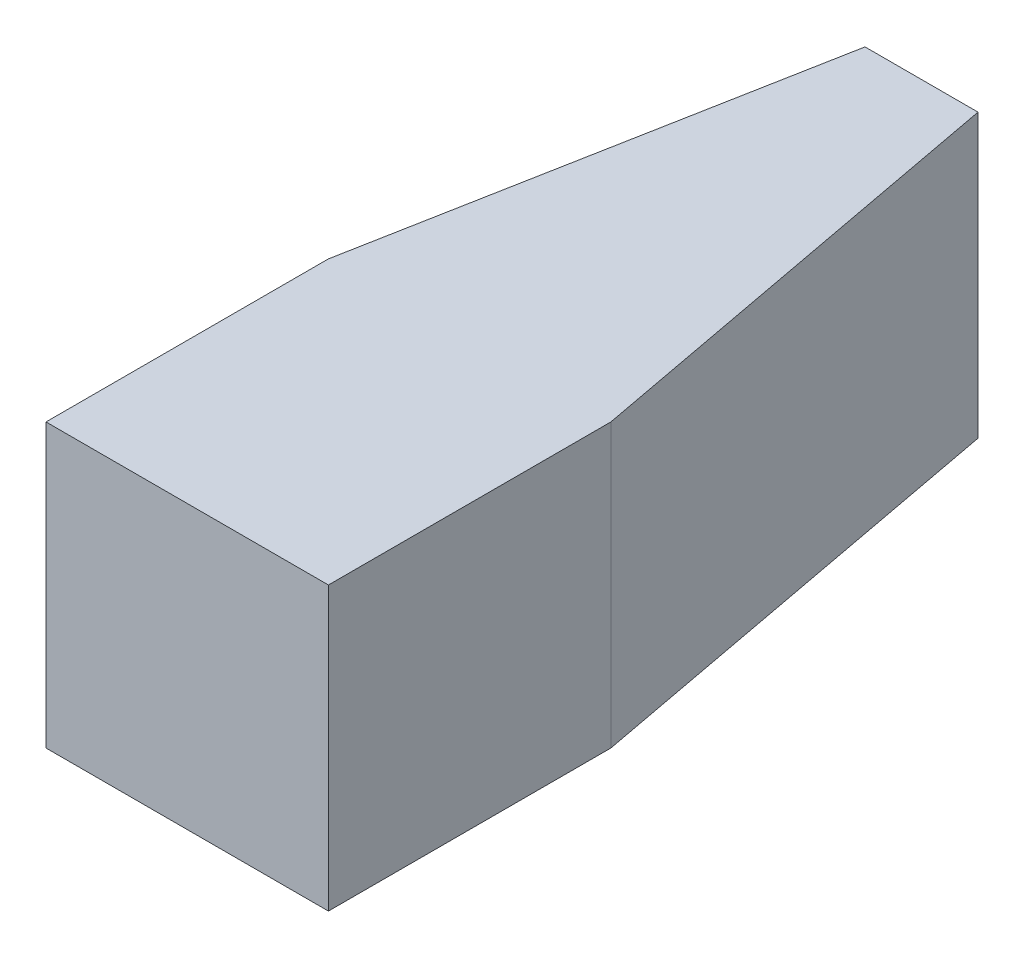
ISO-10303-21;
HEADER;
FILE_DESCRIPTION(('STEP AP214'),'2;1');
FILE_NAME('part.step','',(''),(''),'','','');
FILE_SCHEMA(('AUTOMOTIVE_DESIGN { 1 0 10303 214 1 1 1 1 }'));
ENDSEC;
DATA;
#1=APPLICATION_CONTEXT('core data for automotive mechanical design processes');
#2=APPLICATION_PROTOCOL_DEFINITION('international standard','automotive_design',2000,#1);
#3=PRODUCT_CONTEXT('',#1,'mechanical');
#4=PRODUCT('Part','Part','',(#3));
#5=PRODUCT_RELATED_PRODUCT_CATEGORY('part','',(#4));
#6=PRODUCT_DEFINITION_FORMATION('','',#4);
#7=PRODUCT_DEFINITION_CONTEXT('part definition',#1,'design');
#8=PRODUCT_DEFINITION('design','',#6,#7);
#9=PRODUCT_DEFINITION_SHAPE('','',#8);
#10=(LENGTH_UNIT() NAMED_UNIT(*) SI_UNIT(.MILLI.,.METRE.));
#11=(NAMED_UNIT(*) PLANE_ANGLE_UNIT() SI_UNIT($,.RADIAN.));
#12=(NAMED_UNIT(*) SI_UNIT($,.STERADIAN.) SOLID_ANGLE_UNIT());
#13=UNCERTAINTY_MEASURE_WITH_UNIT(LENGTH_MEASURE(1.E-05),#10,'distance_accuracy_value','');
#14=(GEOMETRIC_REPRESENTATION_CONTEXT(3) GLOBAL_UNCERTAINTY_ASSIGNED_CONTEXT((#13)) GLOBAL_UNIT_ASSIGNED_CONTEXT((#10,
#11,#12)) REPRESENTATION_CONTEXT('',''));
#15=CARTESIAN_POINT('',(0.,0.,0.));
#16=DIRECTION('',(0.,0.,1.));
#17=DIRECTION('',(1.,0.,0.));
#18=AXIS2_PLACEMENT_3D('',#15,#16,#17);
#19=CARTESIAN_POINT('',(-3.175,3.175,-3.175));
#20=DIRECTION('',(1.,0.,0.));
#21=DIRECTION('',(0.,0.,-1.));
#22=AXIS2_PLACEMENT_3D('',#19,#20,#21);
#23=PLANE('',#22);
#24=DIRECTION('',(0.,0.,1.));
#25=VECTOR('',#24,1.);
#26=CARTESIAN_POINT('',(-3.175,0.,-3.175));
#27=LINE('',#26,#25);
#28=CARTESIAN_POINT('',(-3.175,0.,-3.175));
#29=VERTEX_POINT('',#28);
#30=CARTESIAN_POINT('',(-3.175,0.,0.));
#31=VERTEX_POINT('',#30);
#32=EDGE_CURVE('E116',#29,#31,#27,.T.);
#33=ORIENTED_EDGE('',*,*,#32,.T.);
#34=DIRECTION('',(0.,-1.,0.));
#35=VECTOR('',#34,1.);
#36=CARTESIAN_POINT('',(-3.175,3.175,0.));
#37=LINE('',#36,#35);
#38=CARTESIAN_POINT('',(-3.175,3.175,0.));
#39=VERTEX_POINT('',#38);
#40=EDGE_CURVE('E11',#39,#31,#37,.T.);
#41=ORIENTED_EDGE('',*,*,#40,.F.);
#42=DIRECTION('',(0.,0.,1.));
#43=VECTOR('',#42,1.);
#44=CARTESIAN_POINT('',(-3.175,3.175,-3.175));
#45=LINE('',#44,#43);
#46=CARTESIAN_POINT('',(-3.175,3.175,-3.175));
#47=VERTEX_POINT('',#46);
#48=EDGE_CURVE('E126',#47,#39,#45,.T.);
#49=ORIENTED_EDGE('',*,*,#48,.F.);
#50=DIRECTION('',(0.,-1.,0.));
#51=VECTOR('',#50,1.);
#52=CARTESIAN_POINT('',(-3.175,3.175,-3.175));
#53=LINE('',#52,#51);
#54=EDGE_CURVE('E112',#47,#29,#53,.T.);
#55=ORIENTED_EDGE('',*,*,#54,.T.);
#56=EDGE_LOOP('',(#33,#41,#49,#55));
#57=FACE_BOUND('',#56,.T.);
#58=ADVANCED_FACE('F32',(#57),#23,.F.);
#59=CARTESIAN_POINT('',(-3.175,3.175,0.));
#60=DIRECTION('',(0.,0.,-1.));
#61=DIRECTION('',(-1.,0.,0.));
#62=AXIS2_PLACEMENT_3D('',#59,#60,#61);
#63=PLANE('',#62);
#64=DIRECTION('',(1.,0.,0.));
#65=VECTOR('',#64,1.);
#66=CARTESIAN_POINT('',(-3.175,0.,0.));
#67=LINE('',#66,#65);
#68=CARTESIAN_POINT('',(0.,0.,0.));
#69=VERTEX_POINT('',#68);
#70=EDGE_CURVE('E119',#31,#69,#67,.T.);
#71=ORIENTED_EDGE('',*,*,#70,.T.);
#72=DIRECTION('',(0.,-1.,0.));
#73=VECTOR('',#72,1.);
#74=CARTESIAN_POINT('',(0.,3.175,0.));
#75=LINE('',#74,#73);
#76=CARTESIAN_POINT('',(0.,3.175,0.));
#77=VERTEX_POINT('',#76);
#78=EDGE_CURVE('E40',#77,#69,#75,.T.);
#79=ORIENTED_EDGE('',*,*,#78,.F.);
#80=DIRECTION('',(1.,0.,0.));
#81=VECTOR('',#80,1.);
#82=CARTESIAN_POINT('',(-3.175,3.175,0.));
#83=LINE('',#82,#81);
#84=EDGE_CURVE('E85',#39,#77,#83,.T.);
#85=ORIENTED_EDGE('',*,*,#84,.F.);
#86=ORIENTED_EDGE('',*,*,#40,.T.);
#87=EDGE_LOOP('',(#71,#79,#85,#86));
#88=FACE_BOUND('',#87,.T.);
#89=ADVANCED_FACE('F150',(#88),#63,.F.);
#90=CARTESIAN_POINT('',(0.,3.175,0.));
#91=DIRECTION('',(-1.,0.,0.));
#92=DIRECTION('',(0.,0.,1.));
#93=AXIS2_PLACEMENT_3D('',#90,#91,#92);
#94=PLANE('',#93);
#95=DIRECTION('',(0.,0.,-1.));
#96=VECTOR('',#95,1.);
#97=CARTESIAN_POINT('',(0.,0.,0.));
#98=LINE('',#97,#96);
#99=CARTESIAN_POINT('',(0.,0.,-3.175));
#100=VERTEX_POINT('',#99);
#101=EDGE_CURVE('E121',#69,#100,#98,.T.);
#102=ORIENTED_EDGE('',*,*,#101,.T.);
#103=DIRECTION('',(0.,-1.,0.));
#104=VECTOR('',#103,1.);
#105=CARTESIAN_POINT('',(0.,3.175,-3.175));
#106=LINE('',#105,#104);
#107=CARTESIAN_POINT('',(0.,3.175,-3.175));
#108=VERTEX_POINT('',#107);
#109=EDGE_CURVE('E107',#108,#100,#106,.T.);
#110=ORIENTED_EDGE('',*,*,#109,.F.);
#111=DIRECTION('',(0.,0.,-1.));
#112=VECTOR('',#111,1.);
#113=CARTESIAN_POINT('',(0.,3.175,0.));
#114=LINE('',#113,#112);
#115=EDGE_CURVE('E98',#77,#108,#114,.T.);
#116=ORIENTED_EDGE('',*,*,#115,.F.);
#117=ORIENTED_EDGE('',*,*,#78,.T.);
#118=EDGE_LOOP('',(#102,#110,#116,#117));
#119=FACE_BOUND('',#118,.T.);
#120=ADVANCED_FACE('F132',(#119),#94,.F.);
#121=CARTESIAN_POINT('',(0.,3.175,-3.175));
#122=DIRECTION('',(-0.982872186934322,0.,0.184288535050185));
#123=DIRECTION('',(0.184288535050185,0.,0.982872186934322));
#124=AXIS2_PLACEMENT_3D('',#121,#122,#123);
#125=PLANE('',#124);
#126=DIRECTION('',(-0.184288535050185,0.,-0.982872186934322));
#127=VECTOR('',#126,1.);
#128=CARTESIAN_POINT('',(0.,0.,-3.175));
#129=LINE('',#128,#127);
#130=CARTESIAN_POINT('',(-0.952499999999999,0.,-8.255));
#131=VERTEX_POINT('',#130);
#132=EDGE_CURVE('E106',#100,#131,#129,.T.);
#133=ORIENTED_EDGE('',*,*,#132,.T.);
#134=DIRECTION('',(0.,-1.,0.));
#135=VECTOR('',#134,1.);
#136=CARTESIAN_POINT('',(-0.952499999999999,3.175,-8.255));
#137=LINE('',#136,#135);
#138=CARTESIAN_POINT('',(-0.952499999999999,3.175,-8.255));
#139=VERTEX_POINT('',#138);
#140=EDGE_CURVE('E103',#139,#131,#137,.T.);
#141=ORIENTED_EDGE('',*,*,#140,.F.);
#142=DIRECTION('',(-0.184288535050185,0.,-0.982872186934322));
#143=VECTOR('',#142,1.);
#144=CARTESIAN_POINT('',(0.,3.175,-3.175));
#145=LINE('',#144,#143);
#146=EDGE_CURVE('E92',#108,#139,#145,.T.);
#147=ORIENTED_EDGE('',*,*,#146,.F.);
#148=ORIENTED_EDGE('',*,*,#109,.T.);
#149=EDGE_LOOP('',(#133,#141,#147,#148));
#150=FACE_BOUND('',#149,.T.);
#151=ADVANCED_FACE('F104',(#150),#125,.F.);
#152=CARTESIAN_POINT('',(-0.952499999999999,3.175,-8.255));
#153=DIRECTION('',(0.,0.,1.));
#154=DIRECTION('',(1.,0.,0.));
#155=AXIS2_PLACEMENT_3D('',#152,#153,#154);
#156=PLANE('',#155);
#157=DIRECTION('',(-1.,0.,0.));
#158=VECTOR('',#157,1.);
#159=CARTESIAN_POINT('',(-0.952499999999999,0.,-8.255));
#160=LINE('',#159,#158);
#161=CARTESIAN_POINT('',(-2.2225,0.,-8.255));
#162=VERTEX_POINT('',#161);
#163=EDGE_CURVE('E71',#131,#162,#160,.T.);
#164=ORIENTED_EDGE('',*,*,#163,.T.);
#165=DIRECTION('',(0.,-1.,0.));
#166=VECTOR('',#165,1.);
#167=CARTESIAN_POINT('',(-2.2225,3.175,-8.255));
#168=LINE('',#167,#166);
#169=CARTESIAN_POINT('',(-2.2225,3.175,-8.255));
#170=VERTEX_POINT('',#169);
#171=EDGE_CURVE('E108',#170,#162,#168,.T.);
#172=ORIENTED_EDGE('',*,*,#171,.F.);
#173=DIRECTION('',(-1.,0.,0.));
#174=VECTOR('',#173,1.);
#175=CARTESIAN_POINT('',(-0.952499999999999,3.175,-8.255));
#176=LINE('',#175,#174);
#177=EDGE_CURVE('E96',#139,#170,#176,.T.);
#178=ORIENTED_EDGE('',*,*,#177,.F.);
#179=ORIENTED_EDGE('',*,*,#140,.T.);
#180=EDGE_LOOP('',(#164,#172,#178,#179));
#181=FACE_BOUND('',#180,.T.);
#182=ADVANCED_FACE('F110',(#181),#156,.F.);
#183=CARTESIAN_POINT('',(-2.2225,3.175,-8.255));
#184=DIRECTION('',(0.982872186934322,0.,0.184288535050185));
#185=DIRECTION('',(0.184288535050185,0.,-0.982872186934322));
#186=AXIS2_PLACEMENT_3D('',#183,#184,#185);
#187=PLANE('',#186);
#188=DIRECTION('',(-0.184288535050185,0.,0.982872186934322));
#189=VECTOR('',#188,1.);
#190=CARTESIAN_POINT('',(-2.2225,0.,-8.255));
#191=LINE('',#190,#189);
#192=EDGE_CURVE('E77',#162,#29,#191,.T.);
#193=ORIENTED_EDGE('',*,*,#192,.T.);
#194=ORIENTED_EDGE('',*,*,#54,.F.);
#195=DIRECTION('',(-0.184288535050185,0.,0.982872186934322));
#196=VECTOR('',#195,1.);
#197=CARTESIAN_POINT('',(-2.2225,3.175,-8.255));
#198=LINE('',#197,#196);
#199=EDGE_CURVE('E48',#170,#47,#198,.T.);
#200=ORIENTED_EDGE('',*,*,#199,.F.);
#201=ORIENTED_EDGE('',*,*,#171,.T.);
#202=EDGE_LOOP('',(#193,#194,#200,#201));
#203=FACE_BOUND('',#202,.T.);
#204=ADVANCED_FACE('F139',(#203),#187,.F.);
#205=CARTESIAN_POINT('',(-3.175,3.175,0.));
#206=DIRECTION('',(0.,1.,0.));
#207=DIRECTION('',(0.,0.,1.));
#208=AXIS2_PLACEMENT_3D('',#205,#206,#207);
#209=PLANE('',#208);
#210=ORIENTED_EDGE('',*,*,#48,.T.);
#211=ORIENTED_EDGE('',*,*,#84,.T.);
#212=ORIENTED_EDGE('',*,*,#115,.T.);
#213=ORIENTED_EDGE('',*,*,#146,.T.);
#214=ORIENTED_EDGE('',*,*,#177,.T.);
#215=ORIENTED_EDGE('',*,*,#199,.T.);
#216=EDGE_LOOP('',(#210,#211,#212,#213,#214,#215));
#217=FACE_BOUND('',#216,.T.);
#218=ADVANCED_FACE('F94',(#217),#209,.T.);
#219=CARTESIAN_POINT('',(-3.175,0.,0.));
#220=DIRECTION('',(0.,1.,0.));
#221=DIRECTION('',(0.,0.,1.));
#222=AXIS2_PLACEMENT_3D('',#219,#220,#221);
#223=PLANE('',#222);
#224=ORIENTED_EDGE('',*,*,#32,.F.);
#225=ORIENTED_EDGE('',*,*,#192,.F.);
#226=ORIENTED_EDGE('',*,*,#163,.F.);
#227=ORIENTED_EDGE('',*,*,#132,.F.);
#228=ORIENTED_EDGE('',*,*,#101,.F.);
#229=ORIENTED_EDGE('',*,*,#70,.F.);
#230=EDGE_LOOP('',(#224,#225,#226,#227,#228,#229));
#231=FACE_BOUND('',#230,.T.);
#232=ADVANCED_FACE('F135',(#231),#223,.F.);
#233=CLOSED_SHELL('',(#58,#89,#120,#151,#182,#204,#218,#232));
#234=MANIFOLD_SOLID_BREP('B2',#233);
#235=ADVANCED_BREP_SHAPE_REPRESENTATION('',(#18,#234),#14);
#236=SHAPE_DEFINITION_REPRESENTATION(#9,#235);
ENDSEC;
END-ISO-10303-21;
